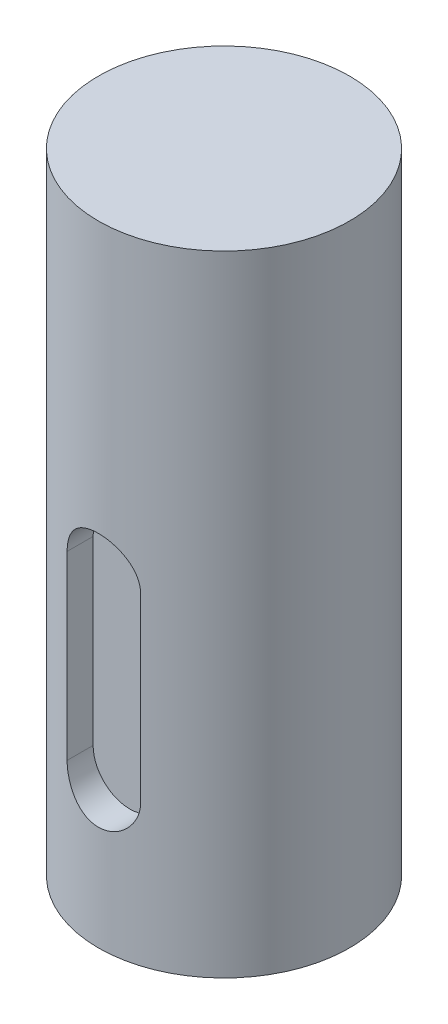
ISO-10303-21;
HEADER;
FILE_DESCRIPTION(('STEP AP214'),'2;1');
FILE_NAME('part.step','',(''),(''),'','','');
FILE_SCHEMA(('AUTOMOTIVE_DESIGN { 1 0 10303 214 1 1 1 1 }'));
ENDSEC;
DATA;
#1=APPLICATION_CONTEXT('core data for automotive mechanical design processes');
#2=APPLICATION_PROTOCOL_DEFINITION('international standard','automotive_design',2000,#1);
#3=PRODUCT_CONTEXT('',#1,'mechanical');
#4=PRODUCT('Part','Part','',(#3));
#5=PRODUCT_RELATED_PRODUCT_CATEGORY('part','',(#4));
#6=PRODUCT_DEFINITION_FORMATION('','',#4);
#7=PRODUCT_DEFINITION_CONTEXT('part definition',#1,'design');
#8=PRODUCT_DEFINITION('design','',#6,#7);
#9=PRODUCT_DEFINITION_SHAPE('','',#8);
#10=(LENGTH_UNIT() NAMED_UNIT(*) SI_UNIT(.MILLI.,.METRE.));
#11=(NAMED_UNIT(*) PLANE_ANGLE_UNIT() SI_UNIT($,.RADIAN.));
#12=(NAMED_UNIT(*) SI_UNIT($,.STERADIAN.) SOLID_ANGLE_UNIT());
#13=UNCERTAINTY_MEASURE_WITH_UNIT(LENGTH_MEASURE(1.E-05),#10,'distance_accuracy_value','');
#14=(GEOMETRIC_REPRESENTATION_CONTEXT(3) GLOBAL_UNCERTAINTY_ASSIGNED_CONTEXT((#13)) GLOBAL_UNIT_ASSIGNED_CONTEXT((#10,
#11,#12)) REPRESENTATION_CONTEXT('',''));
#15=CARTESIAN_POINT('',(0.,0.,0.));
#16=DIRECTION('',(0.,0.,1.));
#17=DIRECTION('',(1.,0.,0.));
#18=AXIS2_PLACEMENT_3D('',#15,#16,#17);
#19=CARTESIAN_POINT('',(0.,100.,0.));
#20=DIRECTION('',(0.,-1.,0.));
#21=DIRECTION('',(0.,0.,-1.));
#22=AXIS2_PLACEMENT_3D('',#19,#20,#21);
#23=CYLINDRICAL_SURFACE('',#22,19.9516950395118);
#24=DIRECTION('',(0.,-1.,0.));
#25=VECTOR('',#24,1.);
#26=CARTESIAN_POINT('',(-5.83963637654913,100.,19.0779658753067));
#27=LINE('',#26,#25);
#28=CARTESIAN_POINT('',(-5.83963637654913,22.4488950439735,19.0779658753067));
#29=VERTEX_POINT('',#28);
#30=CARTESIAN_POINT('',(-5.83963637654913,51.197874128523,19.0779658753067));
#31=VERTEX_POINT('',#30);
#32=EDGE_CURVE('E11',#29,#31,#27,.F.);
#33=ORIENTED_EDGE('',*,*,#32,.T.);
#34=CARTESIAN_POINT('',(-5.83963637654913,51.197874128523,19.0779658753067));
#35=CARTESIAN_POINT('',(-5.8396578928524,51.3583348356888,19.0779435337483));
#36=CARTESIAN_POINT('',(-5.83302367796006,51.5187874693545,19.0799895245909));
#37=CARTESIAN_POINT('',(-5.80660295133836,51.8384720993043,19.0880551171837));
#38=CARTESIAN_POINT('',(-5.78681927725203,51.997704351448,19.094073861615));
#39=CARTESIAN_POINT('',(-5.73432285571671,52.313427953844,19.1099026850459));
#40=CARTESIAN_POINT('',(-5.70164180281641,52.4699250483876,19.1197034686075));
#41=CARTESIAN_POINT('',(-5.62364322897824,52.7794754281399,19.1427906838327));
#42=CARTESIAN_POINT('',(-5.57832540283154,52.9325286300737,19.1560771996847));
#43=CARTESIAN_POINT('',(-5.47545927203025,53.2340625576764,19.1857326711101));
#44=CARTESIAN_POINT('',(-5.41791764730884,53.3825457301933,19.2020999425901));
#45=CARTESIAN_POINT('',(-5.2910190245457,53.6741131034975,19.2374528014113));
#46=CARTESIAN_POINT('',(-5.22165763258719,53.8171952722493,19.2564393619534));
#47=CARTESIAN_POINT('',(-5.07164355449417,54.0970095365284,19.2964916611293));
#48=CARTESIAN_POINT('',(-4.99099056744718,54.2337414626973,19.3175574551686));
#49=CARTESIAN_POINT('',(-4.81892005073536,54.5000716180186,19.3611989036194));
#50=CARTESIAN_POINT('',(-4.72749844399395,54.6296671178415,19.3837751284843));
#51=CARTESIAN_POINT('',(-4.53192713532504,54.8842598309204,19.4304437172503));
#52=CARTESIAN_POINT('',(-4.42750244498753,55.0090414096962,19.454560480405));
#53=CARTESIAN_POINT('',(-4.20860126366974,55.2494751116954,19.5030864266226));
#54=CARTESIAN_POINT('',(-4.09412105208695,55.3651238253923,19.5274957150122));
#55=CARTESIAN_POINT('',(-3.85589090153401,55.586483358831,19.5759293238452));
#56=CARTESIAN_POINT('',(-3.73214278038674,55.6921961183022,19.5999537186659));
#57=CARTESIAN_POINT('',(-3.47608628427464,55.8930486318201,19.6469821305323));
#58=CARTESIAN_POINT('',(-3.34377477217779,55.9881844760101,19.6699857683699));
#59=CARTESIAN_POINT('',(-3.06883890629316,56.1689062939092,19.7147693089451));
#60=CARTESIAN_POINT('',(-2.92606491522709,56.2542728120129,19.7365170719276));
#61=CARTESIAN_POINT('',(-2.63343436910101,56.4126671846659,19.7776893291555));
#62=CARTESIAN_POINT('',(-2.48357514127487,56.4856903346243,19.7971129367445));
#63=CARTESIAN_POINT('',(-2.17795341993251,56.6187256045171,19.8330610639703));
#64=CARTESIAN_POINT('',(-2.02219437904087,56.6787452001598,19.8495872482797));
#65=CARTESIAN_POINT('',(-1.70575908035303,56.7853261027667,19.8792801255019));
#66=CARTESIAN_POINT('',(-1.54508110232667,56.831882640631,19.8924456277469));
#67=CARTESIAN_POINT('',(-1.22454222221604,56.9099935803904,19.914711347341));
#68=CARTESIAN_POINT('',(-1.06478026623907,56.9419251820873,19.9239133631818));
#69=CARTESIAN_POINT('',(-0.742975757471208,56.9923424860465,19.9385070093665));
#70=CARTESIAN_POINT('',(-0.580933238339831,57.0108283865464,19.9438986958882));
#71=CARTESIAN_POINT('',(-0.2558125411768,57.0341802995111,19.9507174358995));
#72=CARTESIAN_POINT('',(-0.0927345379631748,57.0390485527877,19.95214514167));
#73=CARTESIAN_POINT('',(0.233242437771922,57.0351272341699,19.9509975582336));
#74=CARTESIAN_POINT('',(0.396141409336278,57.0263375896114,19.9484222477294));
#75=CARTESIAN_POINT('',(0.71557063781335,56.9956539943552,19.9394789466561));
#76=CARTESIAN_POINT('',(0.872143355225166,56.9741688486979,19.9332293027673));
#77=CARTESIAN_POINT('',(1.18287484303741,56.9186360871544,19.9172090894333));
#78=CARTESIAN_POINT('',(1.33703277457266,56.8845842023955,19.9074373235634));
#79=CARTESIAN_POINT('',(1.7941720004123,56.7639649249952,19.8731984418243));
#80=CARTESIAN_POINT('',(2.09213703367805,56.658902874812,19.8437980863851));
#81=CARTESIAN_POINT('',(2.6693500270759,56.4014443311835,19.7744906037499));
#82=CARTESIAN_POINT('',(2.9483484529503,56.2485264018559,19.7344685102838));
#83=CARTESIAN_POINT('',(3.47739983749556,55.8999225521976,19.6481456578455));
#84=CARTESIAN_POINT('',(3.72744660509871,55.7042275100852,19.601843560527));
#85=CARTESIAN_POINT('',(4.08030245107997,55.3787197077356,19.5303991381385));
#86=CARTESIAN_POINT('',(4.19607007143624,55.2625091349303,19.505794398016));
#87=CARTESIAN_POINT('',(4.4174433435143,55.0207481534677,19.4568534390115));
#88=CARTESIAN_POINT('',(4.5230524837201,54.8952009775072,19.4325171305083));
#89=CARTESIAN_POINT('',(4.7234738633646,54.6354728280917,19.3847765720085));
#90=CARTESIAN_POINT('',(4.81827879187956,54.5012861034496,19.3613729600254));
#91=CARTESIAN_POINT('',(4.99632434522975,54.2252580996148,19.3161929543758));
#92=CARTESIAN_POINT('',(5.07956947370672,54.083419831499,19.2944159285361));
#93=CARTESIAN_POINT('',(5.23466840892652,53.7915538719904,19.2529190948039));
#94=CARTESIAN_POINT('',(5.306403699461,53.641460010252,19.2332213267421));
#95=CARTESIAN_POINT('',(5.43688788859276,53.335455991088,19.1967438782317));
#96=CARTESIAN_POINT('',(5.495642079048,53.1795482341544,19.179963009281));
#97=CARTESIAN_POINT('',(5.59963636998007,52.8631450747829,19.1498600522615));
#98=CARTESIAN_POINT('',(5.64489064021448,52.7026546776847,19.1365343395354));
#99=CARTESIAN_POINT('',(5.72153547151255,52.3781949732717,19.1137584339264));
#100=CARTESIAN_POINT('',(5.75293244167443,52.2142273110707,19.104306449562));
#101=CARTESIAN_POINT('',(5.79801617028295,51.9082515390728,19.0906687794864));
#102=CARTESIAN_POINT('',(5.81362468467193,51.766548720995,19.0859141310347));
#103=CARTESIAN_POINT('',(5.83443294412673,51.4825256485418,19.0795584006393));
#104=CARTESIAN_POINT('',(5.83964830114397,51.3402066425661,19.0779525887684));
#105=CARTESIAN_POINT('',(5.83963637654913,51.197874128523,19.0779658753066));
#106=B_SPLINE_CURVE_WITH_KNOTS('',3,(#34,#35,#36,#37,#38,#39,#40,#41,#42,#43,#44,#45,#46,#47,
#48,#49,#50,#51,#52,#53,#54,#55,#56,#57,#58,#59,#60,#61,#62,#63,#64,#65,#66,#67,#68,#69,#70,#71,
#72,#73,#74,#75,#76,#77,#78,#79,#80,#81,#82,#83,#84,#85,#86,#87,#88,#89,#90,#91,#92,#93,#94,#95,
#96,#97,#98,#99,#100,#101,#102,#103,#104,#105),.UNSPECIFIED.,.F.,.F.,(4,2,2,2,2,2,2,2,2,2,2,2,2,
2,2,2,2,2,2,2,2,2,2,2,2,2,2,2,2,2,2,2,2,2,2,4),(0.,0.481219572017583,0.962335330928406,
1.44227606574893,1.92222839331038,2.40191911316782,2.88178854530098,3.361670768027,
3.84173526514583,4.33463718400974,4.8277222540114,5.32071086152561,5.81388110521898,
6.31655856529473,6.81942718756561,7.32200594035229,7.82476250716234,8.31369935199803,
8.80262898801891,9.29147816493057,9.78032994267154,10.2542377989238,10.7283067882443,
11.6754968098541,12.6333894898038,13.5914866301772,14.0886187808792,14.5855795992846,
15.082874725858,15.5799755618258,16.0819054550096,16.583630353026,17.084826763565,
17.5857911237205,18.0133018097993,18.4401698305189),.UNSPECIFIED.);
#107=CARTESIAN_POINT('',(5.83963637654913,51.197874128523,19.0779658753067));
#108=VERTEX_POINT('',#107);
#109=EDGE_CURVE('E109',#31,#108,#106,.T.);
#110=ORIENTED_EDGE('',*,*,#109,.T.);
#111=DIRECTION('',(0.,-1.,0.));
#112=VECTOR('',#111,1.);
#113=CARTESIAN_POINT('',(5.83963637654913,100.,19.0779658753067));
#114=LINE('',#113,#112);
#115=CARTESIAN_POINT('',(5.83963637654913,22.4488950439735,19.0779658753067));
#116=VERTEX_POINT('',#115);
#117=EDGE_CURVE('E44',#108,#116,#114,.T.);
#118=ORIENTED_EDGE('',*,*,#117,.T.);
#119=CARTESIAN_POINT('',(5.83963637654913,22.4488950439735,19.0779658753067));
#120=CARTESIAN_POINT('',(5.83965789285239,22.2884343368077,19.0779435337483));
#121=CARTESIAN_POINT('',(5.83302367796006,22.127981703142,19.0799895245909));
#122=CARTESIAN_POINT('',(5.80660295133836,21.8082970731923,19.0880551171837));
#123=CARTESIAN_POINT('',(5.78681927725203,21.6490648210485,19.094073861615));
#124=CARTESIAN_POINT('',(5.73432285571671,21.3333412186525,19.1099026850459));
#125=CARTESIAN_POINT('',(5.70164180281641,21.176844124109,19.1197034686075));
#126=CARTESIAN_POINT('',(5.62364322897824,20.8672937443566,19.1427906838327));
#127=CARTESIAN_POINT('',(5.57832540283154,20.7142405424228,19.1560771996847));
#128=CARTESIAN_POINT('',(5.47545927203025,20.4127066148202,19.1857326711101));
#129=CARTESIAN_POINT('',(5.41791764730884,20.2642234423033,19.2020999425901));
#130=CARTESIAN_POINT('',(5.2910190245457,19.972656068999,19.2374528014113));
#131=CARTESIAN_POINT('',(5.22165763258719,19.8295739002473,19.2564393619535));
#132=CARTESIAN_POINT('',(5.07164355449417,19.5497596359681,19.2964916611293));
#133=CARTESIAN_POINT('',(4.99099056744718,19.4130277097993,19.3175574551686));
#134=CARTESIAN_POINT('',(4.81892005073536,19.146697554478,19.3611989036194));
#135=CARTESIAN_POINT('',(4.72749844399395,19.0171020546551,19.3837751284843));
#136=CARTESIAN_POINT('',(4.53192713532504,18.7625093415762,19.4304437172503));
#137=CARTESIAN_POINT('',(4.42750244498753,18.6377277628003,19.454560480405));
#138=CARTESIAN_POINT('',(4.20860126366974,18.3972940608011,19.5030864266226));
#139=CARTESIAN_POINT('',(4.09412105208695,18.2816453471043,19.5274957150122));
#140=CARTESIAN_POINT('',(3.85589090153401,18.0602858136655,19.5759293238452));
#141=CARTESIAN_POINT('',(3.73214278038674,17.9545730541943,19.5999537186659));
#142=CARTESIAN_POINT('',(3.47608628427464,17.7537205406764,19.6469821305323));
#143=CARTESIAN_POINT('',(3.3437747721778,17.6585846964865,19.6699857683699));
#144=CARTESIAN_POINT('',(3.06883890629317,17.4778628785873,19.7147693089451));
#145=CARTESIAN_POINT('',(2.9260649152271,17.3924963604837,19.7365170719276));
#146=CARTESIAN_POINT('',(2.63343436910101,17.2341019878306,19.7776893291555));
#147=CARTESIAN_POINT('',(2.48357514127487,17.1610788378722,19.7971129367445));
#148=CARTESIAN_POINT('',(2.17795341993252,17.0280435679794,19.8330610639703));
#149=CARTESIAN_POINT('',(2.02219437904087,16.9680239723368,19.8495872482797));
#150=CARTESIAN_POINT('',(1.70575908035303,16.8614430697298,19.8792801255019));
#151=CARTESIAN_POINT('',(1.54508110232667,16.8148865318655,19.8924456277469));
#152=CARTESIAN_POINT('',(1.22454222221604,16.7367755921061,19.914711347341));
#153=CARTESIAN_POINT('',(1.06478026623908,16.7048439904093,19.9239133631818));
#154=CARTESIAN_POINT('',(0.742975757471212,16.65442668645,19.9385070093665));
#155=CARTESIAN_POINT('',(0.580933238339835,16.6359407859501,19.9438986958882));
#156=CARTESIAN_POINT('',(0.255812541176805,16.6125888729854,19.9507174358995));
#157=CARTESIAN_POINT('',(0.0927345379631789,16.6077206197088,19.95214514167));
#158=CARTESIAN_POINT('',(-0.233242437771917,16.6116419383267,19.9509975582336));
#159=CARTESIAN_POINT('',(-0.396141409336273,16.6204315828851,19.9484222477294));
#160=CARTESIAN_POINT('',(-0.715570637813346,16.6511151781414,19.9394789466561));
#161=CARTESIAN_POINT('',(-0.872143355225162,16.6726003237986,19.9332293027673));
#162=CARTESIAN_POINT('',(-1.18287484303741,16.7281330853421,19.9172090894333));
#163=CARTESIAN_POINT('',(-1.33703277457266,16.762184970101,19.9074373235634));
#164=CARTESIAN_POINT('',(-1.7941720004123,16.8828042475014,19.8731984418243));
#165=CARTESIAN_POINT('',(-2.09213703367804,16.9878662976845,19.8437980863851));
#166=CARTESIAN_POINT('',(-2.6693500270759,17.245324841313,19.7744906037499));
#167=CARTESIAN_POINT('',(-2.94834845295029,17.3982427706406,19.7344685102838));
#168=CARTESIAN_POINT('',(-3.47739983749556,17.7468466202989,19.6481456578455));
#169=CARTESIAN_POINT('',(-3.72744660509871,17.9425416624113,19.601843560527));
#170=CARTESIAN_POINT('',(-4.08030245107997,18.2680494647609,19.5303991381385));
#171=CARTESIAN_POINT('',(-4.19607007143624,18.3842600375662,19.505794398016));
#172=CARTESIAN_POINT('',(-4.4174433435143,18.6260210190289,19.4568534390115));
#173=CARTESIAN_POINT('',(-4.52305248372009,18.7515681949893,19.4325171305083));
#174=CARTESIAN_POINT('',(-4.7234738633646,19.0112963444048,19.3847765720085));
#175=CARTESIAN_POINT('',(-4.81827879187956,19.1454830690469,19.3613729600254));
#176=CARTESIAN_POINT('',(-4.99632434522975,19.4215110728818,19.3161929543758));
#177=CARTESIAN_POINT('',(-5.07956947370671,19.5633493409975,19.2944159285361));
#178=CARTESIAN_POINT('',(-5.23466840892652,19.8552153005062,19.2529190948039));
#179=CARTESIAN_POINT('',(-5.306403699461,20.0053091622445,19.2332213267421));
#180=CARTESIAN_POINT('',(-5.43688788859276,20.3113131814086,19.1967438782317));
#181=CARTESIAN_POINT('',(-5.495642079048,20.4672209383421,19.179963009281));
#182=CARTESIAN_POINT('',(-5.59963636998006,20.7836240977136,19.1498600522615));
#183=CARTESIAN_POINT('',(-5.64489064021448,20.9441144948118,19.1365343395354));
#184=CARTESIAN_POINT('',(-5.72153547151255,21.2685741992249,19.1137584339264));
#185=CARTESIAN_POINT('',(-5.75293244167443,21.4325418614258,19.104306449562));
#186=CARTESIAN_POINT('',(-5.79801617028294,21.7385176334238,19.0906687794864));
#187=CARTESIAN_POINT('',(-5.81362468467193,21.8802204515015,19.0859141310347));
#188=CARTESIAN_POINT('',(-5.83443294412673,22.1642435239547,19.0795584006394));
#189=CARTESIAN_POINT('',(-5.83964830114397,22.3065625299304,19.0779525887684));
#190=CARTESIAN_POINT('',(-5.83963637654913,22.4488950439735,19.0779658753066));
#191=B_SPLINE_CURVE_WITH_KNOTS('',3,(#119,#120,#121,#122,#123,#124,#125,#126,#127,#128,#129,
#130,#131,#132,#133,#134,#135,#136,#137,#138,#139,#140,#141,#142,#143,#144,#145,#146,#147,#148,
#149,#150,#151,#152,#153,#154,#155,#156,#157,#158,#159,#160,#161,#162,#163,#164,#165,#166,#167,
#168,#169,#170,#171,#172,#173,#174,#175,#176,#177,#178,#179,#180,#181,#182,#183,#184,#185,#186,
#187,#188,#189,#190),.UNSPECIFIED.,.F.,.F.,(4,2,2,2,2,2,2,2,2,2,2,2,2,2,2,2,2,2,2,2,2,2,2,2,2,2,
2,2,2,2,2,2,2,2,2,4),(0.,0.481219572017586,0.962335330928409,1.44227606574893,1.92222839331037,
2.40191911316782,2.88178854530099,3.36167076802699,3.84173526514582,4.33463718400974,
4.8277222540114,5.32071086152561,5.81388110521897,6.31655856529472,6.8194271875656,
7.32200594035228,7.82476250716233,8.31369935199803,8.8026289880189,9.29147816493056,
9.78032994267154,10.2542377989238,10.7283067882443,11.6754968098541,12.6333894898038,
13.5914866301772,14.0886187808792,14.5855795992846,15.082874725858,15.5799755618258,
16.0819054550095,16.583630353026,17.084826763565,17.5857911237204,18.0133018097993,
18.4401698305189),.UNSPECIFIED.);
#192=EDGE_CURVE('E51',#116,#29,#191,.T.);
#193=ORIENTED_EDGE('',*,*,#192,.T.);
#194=EDGE_LOOP('',(#33,#110,#118,#193));
#195=FACE_BOUND('',#194,.T.);
#196=CARTESIAN_POINT('',(0.,100.,0.));
#197=DIRECTION('',(0.,1.,0.));
#198=DIRECTION('',(0.,0.,1.));
#199=AXIS2_PLACEMENT_3D('',#196,#197,#198);
#200=CIRCLE('',#199,19.9516950395118);
#201=CARTESIAN_POINT('',(0.,100.,19.9516950395118));
#202=VERTEX_POINT('',#201);
#203=EDGE_CURVE('E106',#202,#202,#200,.T.);
#204=ORIENTED_EDGE('',*,*,#203,.F.);
#205=EDGE_LOOP('',(#204));
#206=FACE_BOUND('',#205,.T.);
#207=CARTESIAN_POINT('',(0.,0.,0.));
#208=DIRECTION('',(0.,1.,0.));
#209=DIRECTION('',(0.,0.,1.));
#210=AXIS2_PLACEMENT_3D('',#207,#208,#209);
#211=CIRCLE('',#210,19.9516950395118);
#212=CARTESIAN_POINT('',(0.,0.,19.9516950395118));
#213=VERTEX_POINT('',#212);
#214=EDGE_CURVE('E102',#213,#213,#211,.T.);
#215=ORIENTED_EDGE('',*,*,#214,.T.);
#216=EDGE_LOOP('',(#215));
#217=FACE_BOUND('',#216,.T.);
#218=ADVANCED_FACE('F36',(#195,#206,#217),#23,.T.);
#219=CARTESIAN_POINT('',(0.,100.,0.));
#220=DIRECTION('',(0.,1.,0.));
#221=DIRECTION('',(0.,0.,1.));
#222=AXIS2_PLACEMENT_3D('',#219,#220,#221);
#223=PLANE('',#222);
#224=ORIENTED_EDGE('',*,*,#203,.T.);
#225=EDGE_LOOP('',(#224));
#226=FACE_BOUND('',#225,.T.);
#227=ADVANCED_FACE('F137',(#226),#223,.T.);
#228=CARTESIAN_POINT('',(0.,0.,0.));
#229=DIRECTION('',(0.,1.,0.));
#230=DIRECTION('',(0.,0.,1.));
#231=AXIS2_PLACEMENT_3D('',#228,#229,#230);
#232=PLANE('',#231);
#233=ORIENTED_EDGE('',*,*,#214,.F.);
#234=EDGE_LOOP('',(#233));
#235=FACE_BOUND('',#234,.T.);
#236=ADVANCED_FACE('F136',(#235),#232,.F.);
#237=CARTESIAN_POINT('',(0.,22.4488950439735,14.9516950395118));
#238=DIRECTION('',(0.,0.,1.));
#239=DIRECTION('',(1.,0.,0.));
#240=AXIS2_PLACEMENT_3D('',#237,#238,#239);
#241=CYLINDRICAL_SURFACE('',#240,5.83963637654913);
#242=DIRECTION('',(0.,0.,1.));
#243=VECTOR('',#242,1.);
#244=CARTESIAN_POINT('',(5.83963637654913,22.4488950439735,14.9516950395118));
#245=LINE('',#244,#243);
#246=CARTESIAN_POINT('',(5.83963637654913,22.4488950439735,14.9516950395118));
#247=VERTEX_POINT('',#246);
#248=EDGE_CURVE('E74',#247,#116,#245,.T.);
#249=ORIENTED_EDGE('',*,*,#248,.F.);
#250=CARTESIAN_POINT('',(0.,22.4488950439735,14.9516950395118));
#251=DIRECTION('',(0.,0.,1.));
#252=DIRECTION('',(1.,0.,0.));
#253=AXIS2_PLACEMENT_3D('',#250,#251,#252);
#254=CIRCLE('',#253,5.83963637654913);
#255=CARTESIAN_POINT('',(-5.83963637654913,22.4488950439735,14.9516950395118));
#256=VERTEX_POINT('',#255);
#257=EDGE_CURVE('E78',#256,#247,#254,.T.);
#258=ORIENTED_EDGE('',*,*,#257,.F.);
#259=DIRECTION('',(0.,0.,1.));
#260=VECTOR('',#259,1.);
#261=CARTESIAN_POINT('',(-5.83963637654913,22.4488950439735,14.9516950395118));
#262=LINE('',#261,#260);
#263=EDGE_CURVE('E100',#256,#29,#262,.T.);
#264=ORIENTED_EDGE('',*,*,#263,.T.);
#265=ORIENTED_EDGE('',*,*,#192,.F.);
#266=EDGE_LOOP('',(#249,#258,#264,#265));
#267=FACE_BOUND('',#266,.T.);
#268=ADVANCED_FACE('F76',(#267),#241,.F.);
#269=CARTESIAN_POINT('',(-5.83963637654913,22.4488950439735,14.9516950395118));
#270=DIRECTION('',(-1.,0.,0.));
#271=DIRECTION('',(0.,0.,1.));
#272=AXIS2_PLACEMENT_3D('',#269,#270,#271);
#273=PLANE('',#272);
#274=ORIENTED_EDGE('',*,*,#263,.F.);
#275=DIRECTION('',(0.,-1.,0.));
#276=VECTOR('',#275,1.);
#277=CARTESIAN_POINT('',(-5.83963637654913,22.4488950439735,14.9516950395118));
#278=LINE('',#277,#276);
#279=CARTESIAN_POINT('',(-5.83963637654913,51.197874128523,14.9516950395118));
#280=VERTEX_POINT('',#279);
#281=EDGE_CURVE('E83',#280,#256,#278,.T.);
#282=ORIENTED_EDGE('',*,*,#281,.F.);
#283=DIRECTION('',(0.,0.,1.));
#284=VECTOR('',#283,1.);
#285=CARTESIAN_POINT('',(-5.83963637654913,51.197874128523,14.9516950395118));
#286=LINE('',#285,#284);
#287=EDGE_CURVE('E103',#280,#31,#286,.T.);
#288=ORIENTED_EDGE('',*,*,#287,.T.);
#289=ORIENTED_EDGE('',*,*,#32,.F.);
#290=EDGE_LOOP('',(#274,#282,#288,#289));
#291=FACE_BOUND('',#290,.T.);
#292=ADVANCED_FACE('F129',(#291),#273,.F.);
#293=CARTESIAN_POINT('',(0.,51.197874128523,14.9516950395118));
#294=DIRECTION('',(0.,0.,1.));
#295=DIRECTION('',(1.,0.,0.));
#296=AXIS2_PLACEMENT_3D('',#293,#294,#295);
#297=CYLINDRICAL_SURFACE('',#296,5.83963637654913);
#298=ORIENTED_EDGE('',*,*,#287,.F.);
#299=CARTESIAN_POINT('',(0.,51.197874128523,14.9516950395118));
#300=DIRECTION('',(0.,0.,1.));
#301=DIRECTION('',(1.,0.,0.));
#302=AXIS2_PLACEMENT_3D('',#299,#300,#301);
#303=CIRCLE('',#302,5.83963637654913);
#304=CARTESIAN_POINT('',(5.83963637654913,51.197874128523,14.9516950395118));
#305=VERTEX_POINT('',#304);
#306=EDGE_CURVE('E92',#305,#280,#303,.T.);
#307=ORIENTED_EDGE('',*,*,#306,.F.);
#308=DIRECTION('',(0.,0.,1.));
#309=VECTOR('',#308,1.);
#310=CARTESIAN_POINT('',(5.83963637654913,51.197874128523,14.9516950395118));
#311=LINE('',#310,#309);
#312=EDGE_CURVE('E82',#305,#108,#311,.T.);
#313=ORIENTED_EDGE('',*,*,#312,.T.);
#314=ORIENTED_EDGE('',*,*,#109,.F.);
#315=EDGE_LOOP('',(#298,#307,#313,#314));
#316=FACE_BOUND('',#315,.T.);
#317=ADVANCED_FACE('F124',(#316),#297,.F.);
#318=CARTESIAN_POINT('',(5.83963637654913,22.4488950439735,14.9516950395118));
#319=DIRECTION('',(1.,0.,0.));
#320=DIRECTION('',(0.,0.,-1.));
#321=AXIS2_PLACEMENT_3D('',#318,#319,#320);
#322=PLANE('',#321);
#323=ORIENTED_EDGE('',*,*,#312,.F.);
#324=DIRECTION('',(0.,1.,0.));
#325=VECTOR('',#324,1.);
#326=CARTESIAN_POINT('',(5.83963637654913,22.4488950439735,14.9516950395118));
#327=LINE('',#326,#325);
#328=EDGE_CURVE('E86',#247,#305,#327,.T.);
#329=ORIENTED_EDGE('',*,*,#328,.F.);
#330=ORIENTED_EDGE('',*,*,#248,.T.);
#331=ORIENTED_EDGE('',*,*,#117,.F.);
#332=EDGE_LOOP('',(#323,#329,#330,#331));
#333=FACE_BOUND('',#332,.T.);
#334=ADVANCED_FACE('F87',(#333),#322,.F.);
#335=CARTESIAN_POINT('',(0.,22.4488950439735,14.9516950395118));
#336=DIRECTION('',(0.,0.,1.));
#337=DIRECTION('',(1.,0.,0.));
#338=AXIS2_PLACEMENT_3D('',#335,#336,#337);
#339=PLANE('',#338);
#340=ORIENTED_EDGE('',*,*,#257,.T.);
#341=ORIENTED_EDGE('',*,*,#328,.T.);
#342=ORIENTED_EDGE('',*,*,#306,.T.);
#343=ORIENTED_EDGE('',*,*,#281,.T.);
#344=EDGE_LOOP('',(#340,#341,#342,#343));
#345=FACE_BOUND('',#344,.T.);
#346=ADVANCED_FACE('F94',(#345),#339,.T.);
#347=CLOSED_SHELL('',(#218,#227,#236,#268,#292,#317,#334,#346));
#348=MANIFOLD_SOLID_BREP('B2',#347);
#349=ADVANCED_BREP_SHAPE_REPRESENTATION('',(#18,#348),#14);
#350=SHAPE_DEFINITION_REPRESENTATION(#9,#349);
ENDSEC;
END-ISO-10303-21;
